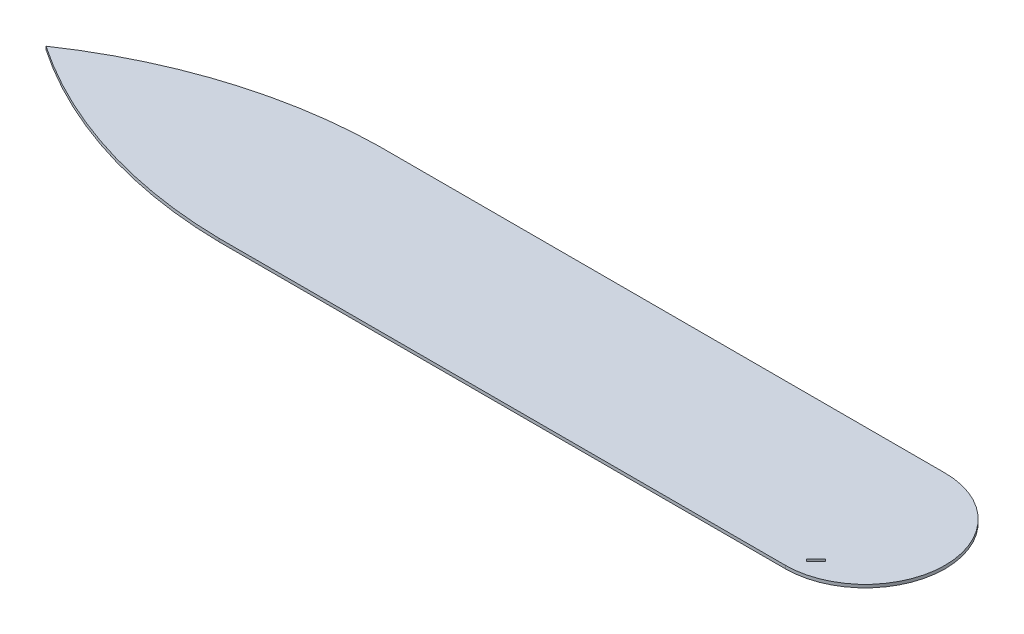
ISO-10303-21;
HEADER;
FILE_DESCRIPTION(('STEP AP214'),'2;1');
FILE_NAME('part.step','',(''),(''),'','','');
FILE_SCHEMA(('AUTOMOTIVE_DESIGN { 1 0 10303 214 1 1 1 1 }'));
ENDSEC;
DATA;
#1=APPLICATION_CONTEXT('core data for automotive mechanical design processes');
#2=APPLICATION_PROTOCOL_DEFINITION('international standard','automotive_design',2000,#1);
#3=PRODUCT_CONTEXT('',#1,'mechanical');
#4=PRODUCT('Part','Part','',(#3));
#5=PRODUCT_RELATED_PRODUCT_CATEGORY('part','',(#4));
#6=PRODUCT_DEFINITION_FORMATION('','',#4);
#7=PRODUCT_DEFINITION_CONTEXT('part definition',#1,'design');
#8=PRODUCT_DEFINITION('design','',#6,#7);
#9=PRODUCT_DEFINITION_SHAPE('','',#8);
#10=(LENGTH_UNIT() NAMED_UNIT(*) SI_UNIT(.MILLI.,.METRE.));
#11=(NAMED_UNIT(*) PLANE_ANGLE_UNIT() SI_UNIT($,.RADIAN.));
#12=(NAMED_UNIT(*) SI_UNIT($,.STERADIAN.) SOLID_ANGLE_UNIT());
#13=UNCERTAINTY_MEASURE_WITH_UNIT(LENGTH_MEASURE(1.E-05),#10,'distance_accuracy_value','');
#14=(GEOMETRIC_REPRESENTATION_CONTEXT(3) GLOBAL_UNCERTAINTY_ASSIGNED_CONTEXT((#13)) GLOBAL_UNIT_ASSIGNED_CONTEXT((#10,
#11,#12)) REPRESENTATION_CONTEXT('',''));
#15=CARTESIAN_POINT('',(0.,0.,0.));
#16=DIRECTION('',(0.,0.,1.));
#17=DIRECTION('',(1.,0.,0.));
#18=AXIS2_PLACEMENT_3D('',#15,#16,#17);
#19=CARTESIAN_POINT('',(800.,3.,78.));
#20=DIRECTION('',(0.,-1.,0.));
#21=DIRECTION('',(0.,0.,1.));
#22=AXIS2_PLACEMENT_3D('',#19,#20,#21);
#23=CYLINDRICAL_SURFACE('',#22,78.);
#24=CARTESIAN_POINT('',(800.,0.,78.));
#25=DIRECTION('',(0.,-1.,0.));
#26=DIRECTION('',(0.,0.,1.));
#27=AXIS2_PLACEMENT_3D('',#24,#25,#26);
#28=CIRCLE('',#27,78.);
#29=CARTESIAN_POINT('',(800.,0.,0.));
#30=VERTEX_POINT('',#29);
#31=CARTESIAN_POINT('',(800.,0.,156.));
#32=VERTEX_POINT('',#31);
#33=EDGE_CURVE('E139',#30,#32,#28,.T.);
#34=ORIENTED_EDGE('',*,*,#33,.F.);
#35=DIRECTION('',(0.,-1.,0.));
#36=VECTOR('',#35,1.);
#37=CARTESIAN_POINT('',(800.,3.,0.));
#38=LINE('',#37,#36);
#39=CARTESIAN_POINT('',(800.,3.,0.));
#40=VERTEX_POINT('',#39);
#41=EDGE_CURVE('E158',#40,#30,#38,.T.);
#42=ORIENTED_EDGE('',*,*,#41,.F.);
#43=CARTESIAN_POINT('',(800.,3.,78.));
#44=DIRECTION('',(0.,-1.,0.));
#45=DIRECTION('',(0.,0.,1.));
#46=AXIS2_PLACEMENT_3D('',#43,#44,#45);
#47=CIRCLE('',#46,78.);
#48=CARTESIAN_POINT('',(800.,3.,156.));
#49=VERTEX_POINT('',#48);
#50=EDGE_CURVE('E143',#40,#49,#47,.T.);
#51=ORIENTED_EDGE('',*,*,#50,.T.);
#52=DIRECTION('',(0.,-1.,0.));
#53=VECTOR('',#52,1.);
#54=CARTESIAN_POINT('',(800.,3.,156.));
#55=LINE('',#54,#53);
#56=EDGE_CURVE('E11',#49,#32,#55,.T.);
#57=ORIENTED_EDGE('',*,*,#56,.T.);
#58=EDGE_LOOP('',(#34,#42,#51,#57));
#59=FACE_BOUND('',#58,.T.);
#60=ADVANCED_FACE('F35',(#59),#23,.T.);
#61=CARTESIAN_POINT('',(247.069884649065,3.,156.));
#62=DIRECTION('',(0.,0.,-1.));
#63=DIRECTION('',(1.,0.,0.));
#64=AXIS2_PLACEMENT_3D('',#61,#62,#63);
#65=PLANE('',#64);
#66=DIRECTION('',(-1.,0.,0.));
#67=VECTOR('',#66,1.);
#68=CARTESIAN_POINT('',(247.069884649065,0.,156.));
#69=LINE('',#68,#67);
#70=CARTESIAN_POINT('',(247.069884649065,0.,156.));
#71=VERTEX_POINT('',#70);
#72=EDGE_CURVE('E161',#32,#71,#69,.T.);
#73=ORIENTED_EDGE('',*,*,#72,.F.);
#74=ORIENTED_EDGE('',*,*,#56,.F.);
#75=DIRECTION('',(-1.,0.,0.));
#76=VECTOR('',#75,1.);
#77=CARTESIAN_POINT('',(247.069884649065,3.,156.));
#78=LINE('',#77,#76);
#79=CARTESIAN_POINT('',(247.069884649065,3.,156.));
#80=VERTEX_POINT('',#79);
#81=EDGE_CURVE('E146',#49,#80,#78,.T.);
#82=ORIENTED_EDGE('',*,*,#81,.T.);
#83=DIRECTION('',(0.,-1.,0.));
#84=VECTOR('',#83,1.);
#85=CARTESIAN_POINT('',(247.069884649065,3.,156.));
#86=LINE('',#85,#84);
#87=EDGE_CURVE('E42',#80,#71,#86,.T.);
#88=ORIENTED_EDGE('',*,*,#87,.T.);
#89=EDGE_LOOP('',(#73,#74,#82,#88));
#90=FACE_BOUND('',#89,.T.);
#91=ADVANCED_FACE('F181',(#90),#65,.F.);
#92=CARTESIAN_POINT('',(253.613216015539,3.,-295.031077899828));
#93=DIRECTION('',(0.,-1.,0.));
#94=DIRECTION('',(0.,0.,1.));
#95=AXIS2_PLACEMENT_3D('',#92,#93,#94);
#96=CYLINDRICAL_SURFACE('',#95,451.078539078121);
#97=CARTESIAN_POINT('',(253.613216015539,0.,-295.031077899828));
#98=DIRECTION('',(0.,-1.,0.));
#99=DIRECTION('',(0.,0.,-1.));
#100=AXIS2_PLACEMENT_3D('',#97,#98,#99);
#101=CIRCLE('',#100,451.078539078121);
#102=CARTESIAN_POINT('',(1.11022302462516E-13,0.,78.));
#103=VERTEX_POINT('',#102);
#104=EDGE_CURVE('E164',#71,#103,#101,.T.);
#105=ORIENTED_EDGE('',*,*,#104,.F.);
#106=ORIENTED_EDGE('',*,*,#87,.F.);
#107=CARTESIAN_POINT('',(253.613216015539,3.,-295.031077899828));
#108=DIRECTION('',(0.,-1.,0.));
#109=DIRECTION('',(0.,0.,-1.));
#110=AXIS2_PLACEMENT_3D('',#107,#108,#109);
#111=CIRCLE('',#110,451.078539078121);
#112=CARTESIAN_POINT('',(1.11022302462516E-13,3.,78.));
#113=VERTEX_POINT('',#112);
#114=EDGE_CURVE('E150',#80,#113,#111,.T.);
#115=ORIENTED_EDGE('',*,*,#114,.T.);
#116=DIRECTION('',(0.,-1.,0.));
#117=VECTOR('',#116,1.);
#118=CARTESIAN_POINT('',(1.11022302462516E-13,3.,78.));
#119=LINE('',#118,#117);
#120=EDGE_CURVE('E176',#113,#103,#119,.T.);
#121=ORIENTED_EDGE('',*,*,#120,.T.);
#122=EDGE_LOOP('',(#105,#106,#115,#121));
#123=FACE_BOUND('',#122,.T.);
#124=ADVANCED_FACE('F192',(#123),#96,.T.);
#125=CARTESIAN_POINT('',(253.613216015539,3.,451.031077899828));
#126=DIRECTION('',(0.,-1.,0.));
#127=DIRECTION('',(0.,0.,1.));
#128=AXIS2_PLACEMENT_3D('',#125,#126,#127);
#129=CYLINDRICAL_SURFACE('',#128,451.078539078121);
#130=CARTESIAN_POINT('',(253.613216015539,0.,451.031077899828));
#131=DIRECTION('',(0.,-1.,0.));
#132=DIRECTION('',(0.,0.,1.));
#133=AXIS2_PLACEMENT_3D('',#130,#131,#132);
#134=CIRCLE('',#133,451.078539078121);
#135=CARTESIAN_POINT('',(247.069884649065,0.,0.));
#136=VERTEX_POINT('',#135);
#137=EDGE_CURVE('E167',#103,#136,#134,.T.);
#138=ORIENTED_EDGE('',*,*,#137,.F.);
#139=ORIENTED_EDGE('',*,*,#120,.F.);
#140=CARTESIAN_POINT('',(253.613216015539,3.,451.031077899828));
#141=DIRECTION('',(0.,-1.,0.));
#142=DIRECTION('',(0.,0.,1.));
#143=AXIS2_PLACEMENT_3D('',#140,#141,#142);
#144=CIRCLE('',#143,451.078539078121);
#145=CARTESIAN_POINT('',(247.069884649065,3.,0.));
#146=VERTEX_POINT('',#145);
#147=EDGE_CURVE('E153',#113,#146,#144,.T.);
#148=ORIENTED_EDGE('',*,*,#147,.T.);
#149=DIRECTION('',(0.,-1.,0.));
#150=VECTOR('',#149,1.);
#151=CARTESIAN_POINT('',(247.069884649065,3.,0.));
#152=LINE('',#151,#150);
#153=EDGE_CURVE('E173',#146,#136,#152,.T.);
#154=ORIENTED_EDGE('',*,*,#153,.T.);
#155=EDGE_LOOP('',(#138,#139,#148,#154));
#156=FACE_BOUND('',#155,.T.);
#157=ADVANCED_FACE('F194',(#156),#129,.T.);
#158=CARTESIAN_POINT('',(247.069884649065,3.,0.));
#159=DIRECTION('',(0.,0.,1.));
#160=DIRECTION('',(-1.,0.,0.));
#161=AXIS2_PLACEMENT_3D('',#158,#159,#160);
#162=PLANE('',#161);
#163=DIRECTION('',(1.,0.,0.));
#164=VECTOR('',#163,1.);
#165=CARTESIAN_POINT('',(247.069884649065,0.,0.));
#166=LINE('',#165,#164);
#167=EDGE_CURVE('E147',#136,#30,#166,.T.);
#168=ORIENTED_EDGE('',*,*,#167,.F.);
#169=ORIENTED_EDGE('',*,*,#153,.F.);
#170=DIRECTION('',(1.,0.,0.));
#171=VECTOR('',#170,1.);
#172=CARTESIAN_POINT('',(247.069884649065,3.,0.));
#173=LINE('',#172,#171);
#174=EDGE_CURVE('E156',#146,#40,#173,.T.);
#175=ORIENTED_EDGE('',*,*,#174,.T.);
#176=ORIENTED_EDGE('',*,*,#41,.T.);
#177=EDGE_LOOP('',(#168,#169,#175,#176));
#178=FACE_BOUND('',#177,.T.);
#179=ADVANCED_FACE('F196',(#178),#162,.F.);
#180=CARTESIAN_POINT('',(800.,3.,78.));
#181=DIRECTION('',(0.,-1.,0.));
#182=DIRECTION('',(0.,0.,1.));
#183=AXIS2_PLACEMENT_3D('',#180,#181,#182);
#184=PLANE('',#183);
#185=DIRECTION('',(0.707106781186546,0.,-0.707106781186549));
#186=VECTOR('',#185,1.);
#187=CARTESIAN_POINT('',(807.103966156764,3.,142.445473852481));
#188=LINE('',#187,#186);
#189=CARTESIAN_POINT('',(807.103966156764,3.,142.445473852481));
#190=VERTEX_POINT('',#189);
#191=CARTESIAN_POINT('',(816.296354312189,3.,133.253085697056));
#192=VERTEX_POINT('',#191);
#193=EDGE_CURVE('E112',#190,#192,#188,.T.);
#194=ORIENTED_EDGE('',*,*,#193,.F.);
#195=DIRECTION('',(0.707106781186538,0.,0.707106781186557));
#196=VECTOR('',#195,1.);
#197=CARTESIAN_POINT('',(804.982645813204,3.,140.324153508921));
#198=LINE('',#197,#196);
#199=CARTESIAN_POINT('',(804.982645813204,3.,140.324153508921));
#200=VERTEX_POINT('',#199);
#201=EDGE_CURVE('E125',#200,#190,#198,.T.);
#202=ORIENTED_EDGE('',*,*,#201,.F.);
#203=DIRECTION('',(-0.707106781186547,0.,0.707106781186547));
#204=VECTOR('',#203,1.);
#205=CARTESIAN_POINT('',(814.175033968629,3.,131.131765353496));
#206=LINE('',#205,#204);
#207=CARTESIAN_POINT('',(814.175033968629,3.,131.131765353496));
#208=VERTEX_POINT('',#207);
#209=EDGE_CURVE('E107',#208,#200,#206,.T.);
#210=ORIENTED_EDGE('',*,*,#209,.F.);
#211=DIRECTION('',(-0.707106781186543,0.,-0.707106781186552));
#212=VECTOR('',#211,1.);
#213=CARTESIAN_POINT('',(816.296354312189,3.,133.253085697056));
#214=LINE('',#213,#212);
#215=EDGE_CURVE('E115',#192,#208,#214,.T.);
#216=ORIENTED_EDGE('',*,*,#215,.F.);
#217=EDGE_LOOP('',(#194,#202,#210,#216));
#218=FACE_BOUND('',#217,.T.);
#219=ORIENTED_EDGE('',*,*,#50,.F.);
#220=ORIENTED_EDGE('',*,*,#174,.F.);
#221=ORIENTED_EDGE('',*,*,#147,.F.);
#222=ORIENTED_EDGE('',*,*,#114,.F.);
#223=ORIENTED_EDGE('',*,*,#81,.F.);
#224=EDGE_LOOP('',(#219,#220,#221,#222,#223));
#225=FACE_BOUND('',#224,.T.);
#226=ADVANCED_FACE('F123',(#218,#225),#184,.F.);
#227=CARTESIAN_POINT('',(800.,0.,78.));
#228=DIRECTION('',(0.,-1.,0.));
#229=DIRECTION('',(0.,0.,1.));
#230=AXIS2_PLACEMENT_3D('',#227,#228,#229);
#231=PLANE('',#230);
#232=DIRECTION('',(-0.707106781186543,0.,-0.707106781186552));
#233=VECTOR('',#232,1.);
#234=CARTESIAN_POINT('',(816.296354312189,0.,133.253085697056));
#235=LINE('',#234,#233);
#236=CARTESIAN_POINT('',(816.296354312189,0.,133.253085697056));
#237=VERTEX_POINT('',#236);
#238=CARTESIAN_POINT('',(814.175033968629,0.,131.131765353496));
#239=VERTEX_POINT('',#238);
#240=EDGE_CURVE('E130',#237,#239,#235,.T.);
#241=ORIENTED_EDGE('',*,*,#240,.T.);
#242=DIRECTION('',(-0.707106781186547,0.,0.707106781186547));
#243=VECTOR('',#242,1.);
#244=CARTESIAN_POINT('',(814.175033968629,0.,131.131765353496));
#245=LINE('',#244,#243);
#246=CARTESIAN_POINT('',(804.982645813204,0.,140.324153508921));
#247=VERTEX_POINT('',#246);
#248=EDGE_CURVE('E110',#239,#247,#245,.T.);
#249=ORIENTED_EDGE('',*,*,#248,.T.);
#250=DIRECTION('',(0.707106781186538,0.,0.707106781186557));
#251=VECTOR('',#250,1.);
#252=CARTESIAN_POINT('',(804.982645813204,0.,140.324153508921));
#253=LINE('',#252,#251);
#254=CARTESIAN_POINT('',(807.103966156764,0.,142.445473852481));
#255=VERTEX_POINT('',#254);
#256=EDGE_CURVE('E133',#247,#255,#253,.T.);
#257=ORIENTED_EDGE('',*,*,#256,.T.);
#258=DIRECTION('',(0.707106781186546,0.,-0.707106781186549));
#259=VECTOR('',#258,1.);
#260=CARTESIAN_POINT('',(807.103966156764,0.,142.445473852481));
#261=LINE('',#260,#259);
#262=EDGE_CURVE('E121',#255,#237,#261,.T.);
#263=ORIENTED_EDGE('',*,*,#262,.T.);
#264=EDGE_LOOP('',(#241,#249,#257,#263));
#265=FACE_BOUND('',#264,.T.);
#266=ORIENTED_EDGE('',*,*,#33,.T.);
#267=ORIENTED_EDGE('',*,*,#72,.T.);
#268=ORIENTED_EDGE('',*,*,#104,.T.);
#269=ORIENTED_EDGE('',*,*,#137,.T.);
#270=ORIENTED_EDGE('',*,*,#167,.T.);
#271=EDGE_LOOP('',(#266,#267,#268,#269,#270));
#272=FACE_BOUND('',#271,.T.);
#273=ADVANCED_FACE('F185',(#265,#272),#231,.T.);
#274=CARTESIAN_POINT('',(816.296354312189,3.,133.253085697056));
#275=DIRECTION('',(0.707106781186552,0.,-0.707106781186543));
#276=DIRECTION('',(0.707106781186543,0.,0.707106781186552));
#277=AXIS2_PLACEMENT_3D('',#274,#275,#276);
#278=PLANE('',#277);
#279=ORIENTED_EDGE('',*,*,#240,.F.);
#280=DIRECTION('',(0.,-1.,0.));
#281=VECTOR('',#280,1.);
#282=CARTESIAN_POINT('',(816.296354312189,3.,133.253085697056));
#283=LINE('',#282,#281);
#284=EDGE_CURVE('E117',#192,#237,#283,.T.);
#285=ORIENTED_EDGE('',*,*,#284,.F.);
#286=ORIENTED_EDGE('',*,*,#215,.T.);
#287=DIRECTION('',(0.,-1.,0.));
#288=VECTOR('',#287,1.);
#289=CARTESIAN_POINT('',(814.175033968629,3.,131.131765353496));
#290=LINE('',#289,#288);
#291=EDGE_CURVE('E57',#208,#239,#290,.T.);
#292=ORIENTED_EDGE('',*,*,#291,.T.);
#293=EDGE_LOOP('',(#279,#285,#286,#292));
#294=FACE_BOUND('',#293,.T.);
#295=ADVANCED_FACE('F116',(#294),#278,.F.);
#296=CARTESIAN_POINT('',(807.103966156764,3.,142.445473852481));
#297=DIRECTION('',(0.707106781186548,0.,0.707106781186546));
#298=DIRECTION('',(-0.707106781186546,0.,0.707106781186549));
#299=AXIS2_PLACEMENT_3D('',#296,#297,#298);
#300=PLANE('',#299);
#301=ORIENTED_EDGE('',*,*,#262,.F.);
#302=DIRECTION('',(0.,-1.,0.));
#303=VECTOR('',#302,1.);
#304=CARTESIAN_POINT('',(807.103966156764,3.,142.445473852481));
#305=LINE('',#304,#303);
#306=EDGE_CURVE('E140',#190,#255,#305,.T.);
#307=ORIENTED_EDGE('',*,*,#306,.F.);
#308=ORIENTED_EDGE('',*,*,#193,.T.);
#309=ORIENTED_EDGE('',*,*,#284,.T.);
#310=EDGE_LOOP('',(#301,#307,#308,#309));
#311=FACE_BOUND('',#310,.T.);
#312=ADVANCED_FACE('F247',(#311),#300,.F.);
#313=CARTESIAN_POINT('',(804.982645813204,3.,140.324153508921));
#314=DIRECTION('',(-0.707106781186557,0.,0.707106781186538));
#315=DIRECTION('',(-0.707106781186538,0.,-0.707106781186557));
#316=AXIS2_PLACEMENT_3D('',#313,#314,#315);
#317=PLANE('',#316);
#318=ORIENTED_EDGE('',*,*,#256,.F.);
#319=DIRECTION('',(0.,-1.,0.));
#320=VECTOR('',#319,1.);
#321=CARTESIAN_POINT('',(804.982645813204,3.,140.324153508921));
#322=LINE('',#321,#320);
#323=EDGE_CURVE('E49',#200,#247,#322,.T.);
#324=ORIENTED_EDGE('',*,*,#323,.F.);
#325=ORIENTED_EDGE('',*,*,#201,.T.);
#326=ORIENTED_EDGE('',*,*,#306,.T.);
#327=EDGE_LOOP('',(#318,#324,#325,#326));
#328=FACE_BOUND('',#327,.T.);
#329=ADVANCED_FACE('F256',(#328),#317,.F.);
#330=CARTESIAN_POINT('',(814.175033968629,3.,131.131765353496));
#331=DIRECTION('',(-0.707106781186548,0.,-0.707106781186548));
#332=DIRECTION('',(0.707106781186548,0.,-0.707106781186548));
#333=AXIS2_PLACEMENT_3D('',#330,#331,#332);
#334=PLANE('',#333);
#335=ORIENTED_EDGE('',*,*,#248,.F.);
#336=ORIENTED_EDGE('',*,*,#291,.F.);
#337=ORIENTED_EDGE('',*,*,#209,.T.);
#338=ORIENTED_EDGE('',*,*,#323,.T.);
#339=EDGE_LOOP('',(#335,#336,#337,#338));
#340=FACE_BOUND('',#339,.T.);
#341=ADVANCED_FACE('F105',(#340),#334,.F.);
#342=CLOSED_SHELL('',(#60,#91,#124,#157,#179,#226,#273,#295,#312,#329,#341));
#343=MANIFOLD_SOLID_BREP('B2',#342);
#344=ADVANCED_BREP_SHAPE_REPRESENTATION('',(#18,#343),#14);
#345=SHAPE_DEFINITION_REPRESENTATION(#9,#344);
ENDSEC;
END-ISO-10303-21;
